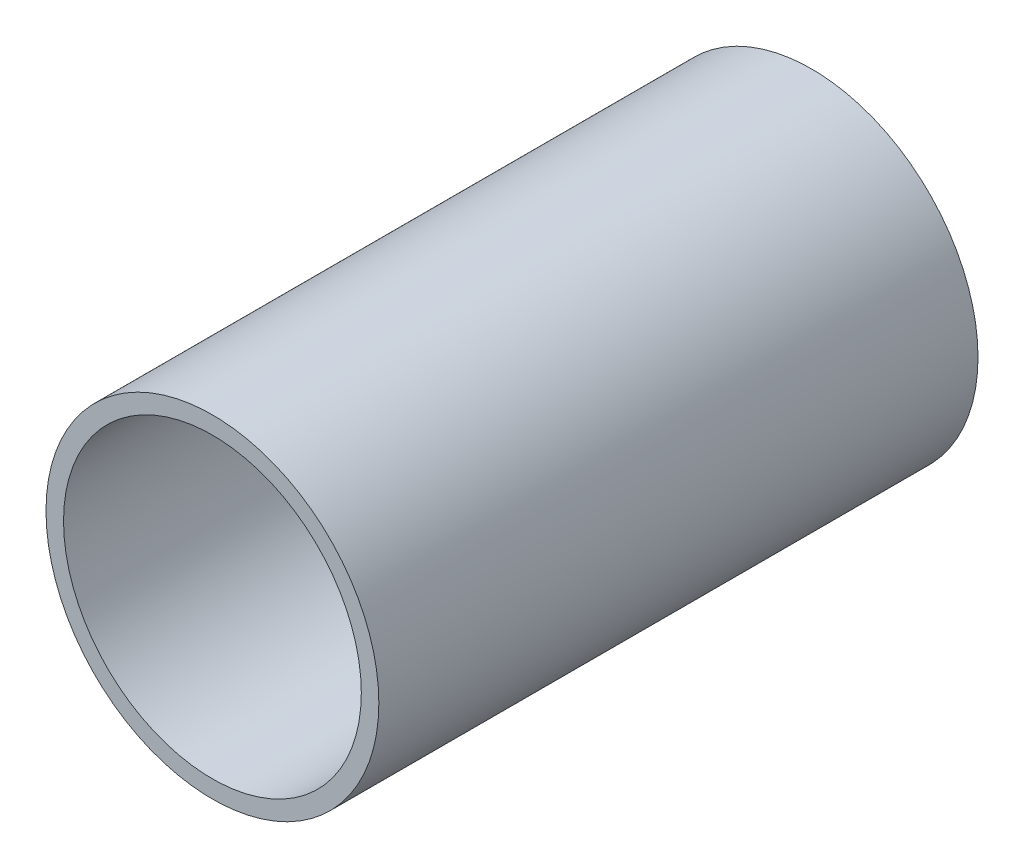
ISO-10303-21;
HEADER;
FILE_DESCRIPTION(('STEP AP214'),'2;1');
FILE_NAME('part.step','',(''),(''),'','','');
FILE_SCHEMA(('AUTOMOTIVE_DESIGN { 1 0 10303 214 1 1 1 1 }'));
ENDSEC;
DATA;
#1=APPLICATION_CONTEXT('core data for automotive mechanical design processes');
#2=APPLICATION_PROTOCOL_DEFINITION('international standard','automotive_design',2000,#1);
#3=PRODUCT_CONTEXT('',#1,'mechanical');
#4=PRODUCT('Part','Part','',(#3));
#5=PRODUCT_RELATED_PRODUCT_CATEGORY('part','',(#4));
#6=PRODUCT_DEFINITION_FORMATION('','',#4);
#7=PRODUCT_DEFINITION_CONTEXT('part definition',#1,'design');
#8=PRODUCT_DEFINITION('design','',#6,#7);
#9=PRODUCT_DEFINITION_SHAPE('','',#8);
#10=(LENGTH_UNIT() NAMED_UNIT(*) SI_UNIT(.MILLI.,.METRE.));
#11=(NAMED_UNIT(*) PLANE_ANGLE_UNIT() SI_UNIT($,.RADIAN.));
#12=(NAMED_UNIT(*) SI_UNIT($,.STERADIAN.) SOLID_ANGLE_UNIT());
#13=UNCERTAINTY_MEASURE_WITH_UNIT(LENGTH_MEASURE(1.E-05),#10,'distance_accuracy_value','');
#14=(GEOMETRIC_REPRESENTATION_CONTEXT(3) GLOBAL_UNCERTAINTY_ASSIGNED_CONTEXT((#13)) GLOBAL_UNIT_ASSIGNED_CONTEXT((#10,
#11,#12)) REPRESENTATION_CONTEXT('',''));
#15=CARTESIAN_POINT('',(0.,0.,0.));
#16=DIRECTION('',(0.,0.,1.));
#17=DIRECTION('',(1.,0.,0.));
#18=AXIS2_PLACEMENT_3D('',#15,#16,#17);
#19=CARTESIAN_POINT('',(0.,0.,102.875));
#20=DIRECTION('',(0.,0.,1.));
#21=DIRECTION('',(1.,0.,0.));
#22=AXIS2_PLACEMENT_3D('',#19,#20,#21);
#23=PLANE('',#22);
#24=CARTESIAN_POINT('',(0.,0.,102.875));
#25=DIRECTION('',(0.,0.,1.));
#26=DIRECTION('',(1.,0.,0.));
#27=AXIS2_PLACEMENT_3D('',#24,#25,#26);
#28=CIRCLE('',#27,57.15);
#29=CARTESIAN_POINT('',(57.15,0.,102.875));
#30=VERTEX_POINT('',#29);
#31=EDGE_CURVE('E13',#30,#30,#28,.T.);
#32=ORIENTED_EDGE('',*,*,#31,.T.);
#33=EDGE_LOOP('',(#32));
#34=FACE_BOUND('',#33,.T.);
#35=CARTESIAN_POINT('',(0.,0.,102.875));
#36=DIRECTION('',(0.,0.,1.));
#37=DIRECTION('',(1.,0.,0.));
#38=AXIS2_PLACEMENT_3D('',#35,#36,#37);
#39=CIRCLE('',#38,51.1302);
#40=CARTESIAN_POINT('',(51.1302,0.,102.875));
#41=VERTEX_POINT('',#40);
#42=EDGE_CURVE('E56',#41,#41,#39,.T.);
#43=ORIENTED_EDGE('',*,*,#42,.F.);
#44=EDGE_LOOP('',(#43));
#45=FACE_BOUND('',#44,.T.);
#46=ADVANCED_FACE('F45',(#34,#45),#23,.T.);
#47=CARTESIAN_POINT('',(0.,0.,-102.875));
#48=DIRECTION('',(0.,0.,1.));
#49=DIRECTION('',(1.,0.,0.));
#50=AXIS2_PLACEMENT_3D('',#47,#48,#49);
#51=PLANE('',#50);
#52=CARTESIAN_POINT('',(0.,0.,-102.875));
#53=DIRECTION('',(0.,0.,1.));
#54=DIRECTION('',(1.,0.,0.));
#55=AXIS2_PLACEMENT_3D('',#52,#53,#54);
#56=CIRCLE('',#55,57.15);
#57=CARTESIAN_POINT('',(57.15,0.,-102.875));
#58=VERTEX_POINT('',#57);
#59=EDGE_CURVE('E49',#58,#58,#56,.T.);
#60=ORIENTED_EDGE('',*,*,#59,.F.);
#61=EDGE_LOOP('',(#60));
#62=FACE_BOUND('',#61,.T.);
#63=CARTESIAN_POINT('',(0.,0.,-102.875));
#64=DIRECTION('',(0.,0.,1.));
#65=DIRECTION('',(1.,0.,0.));
#66=AXIS2_PLACEMENT_3D('',#63,#64,#65);
#67=CIRCLE('',#66,51.1302);
#68=CARTESIAN_POINT('',(51.1302,0.,-102.875));
#69=VERTEX_POINT('',#68);
#70=EDGE_CURVE('E58',#69,#69,#67,.T.);
#71=ORIENTED_EDGE('',*,*,#70,.T.);
#72=EDGE_LOOP('',(#71));
#73=FACE_BOUND('',#72,.T.);
#74=ADVANCED_FACE('F68',(#62,#73),#51,.F.);
#75=CARTESIAN_POINT('',(0.,0.,102.875));
#76=DIRECTION('',(0.,0.,-1.));
#77=DIRECTION('',(-1.,0.,0.));
#78=AXIS2_PLACEMENT_3D('',#75,#76,#77);
#79=CYLINDRICAL_SURFACE('',#78,57.15);
#80=ORIENTED_EDGE('',*,*,#31,.F.);
#81=EDGE_LOOP('',(#80));
#82=FACE_BOUND('',#81,.T.);
#83=ORIENTED_EDGE('',*,*,#59,.T.);
#84=EDGE_LOOP('',(#83));
#85=FACE_BOUND('',#84,.T.);
#86=ADVANCED_FACE('F47',(#82,#85),#79,.T.);
#87=CARTESIAN_POINT('',(0.,0.,102.875));
#88=DIRECTION('',(0.,0.,-1.));
#89=DIRECTION('',(-1.,0.,0.));
#90=AXIS2_PLACEMENT_3D('',#87,#88,#89);
#91=CYLINDRICAL_SURFACE('',#90,51.1302);
#92=ORIENTED_EDGE('',*,*,#42,.T.);
#93=EDGE_LOOP('',(#92));
#94=FACE_BOUND('',#93,.T.);
#95=ORIENTED_EDGE('',*,*,#70,.F.);
#96=EDGE_LOOP('',(#95));
#97=FACE_BOUND('',#96,.T.);
#98=ADVANCED_FACE('F64',(#94,#97),#91,.F.);
#99=CLOSED_SHELL('',(#46,#74,#86,#98));
#100=MANIFOLD_SOLID_BREP('B2',#99);
#101=ADVANCED_BREP_SHAPE_REPRESENTATION('',(#18,#100),#14);
#102=SHAPE_DEFINITION_REPRESENTATION(#9,#101);
ENDSEC;
END-ISO-10303-21;
